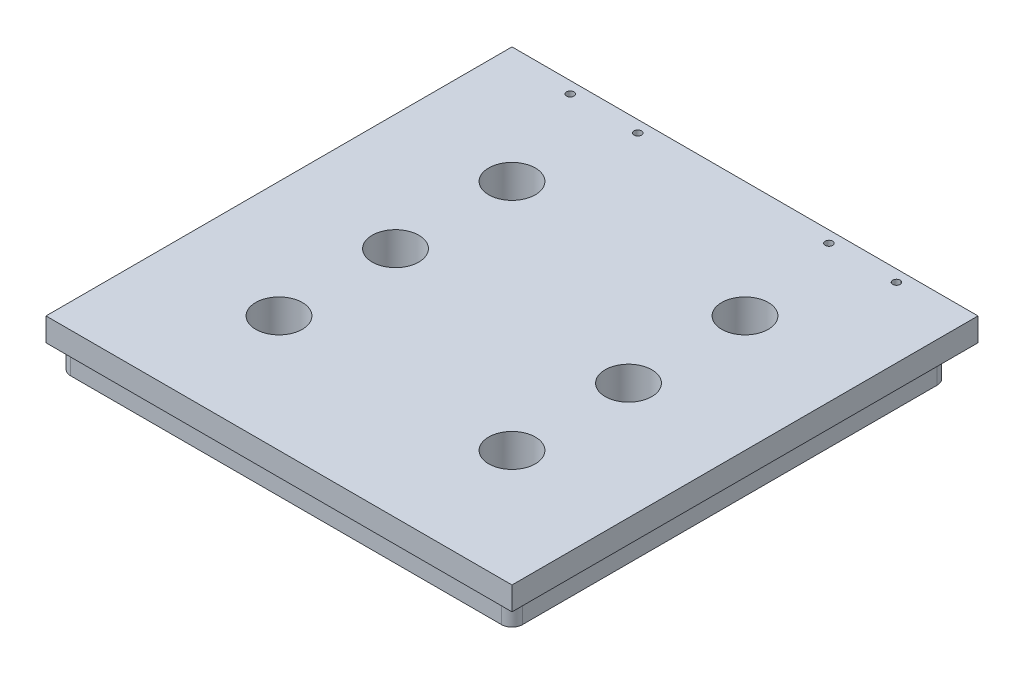
ISO-10303-21;
HEADER;
FILE_DESCRIPTION(('STEP AP214'),'2;1');
FILE_NAME('part.step','',(''),(''),'','','');
FILE_SCHEMA(('AUTOMOTIVE_DESIGN { 1 0 10303 214 1 1 1 1 }'));
ENDSEC;
DATA;
#1=APPLICATION_CONTEXT('core data for automotive mechanical design processes');
#2=APPLICATION_PROTOCOL_DEFINITION('international standard','automotive_design',2000,#1);
#3=PRODUCT_CONTEXT('',#1,'mechanical');
#4=PRODUCT('Part','Part','',(#3));
#5=PRODUCT_RELATED_PRODUCT_CATEGORY('part','',(#4));
#6=PRODUCT_DEFINITION_FORMATION('','',#4);
#7=PRODUCT_DEFINITION_CONTEXT('part definition',#1,'design');
#8=PRODUCT_DEFINITION('design','',#6,#7);
#9=PRODUCT_DEFINITION_SHAPE('','',#8);
#10=(LENGTH_UNIT() NAMED_UNIT(*) SI_UNIT(.MILLI.,.METRE.));
#11=(NAMED_UNIT(*) PLANE_ANGLE_UNIT() SI_UNIT($,.RADIAN.));
#12=(NAMED_UNIT(*) SI_UNIT($,.STERADIAN.) SOLID_ANGLE_UNIT());
#13=UNCERTAINTY_MEASURE_WITH_UNIT(LENGTH_MEASURE(1.E-05),#10,'distance_accuracy_value','');
#14=(GEOMETRIC_REPRESENTATION_CONTEXT(3) GLOBAL_UNCERTAINTY_ASSIGNED_CONTEXT((#13)) GLOBAL_UNIT_ASSIGNED_CONTEXT((#10,
#11,#12)) REPRESENTATION_CONTEXT('',''));
#15=CARTESIAN_POINT('',(0.,0.,0.));
#16=DIRECTION('',(0.,0.,1.));
#17=DIRECTION('',(1.,0.,0.));
#18=AXIS2_PLACEMENT_3D('',#15,#16,#17);
#19=CARTESIAN_POINT('',(0.,0.,0.));
#20=DIRECTION('',(0.,1.,0.));
#21=DIRECTION('',(0.,0.,1.));
#22=AXIS2_PLACEMENT_3D('',#19,#20,#21);
#23=PLANE('',#22);
#24=CARTESIAN_POINT('',(70.,0.,-95.));
#25=DIRECTION('',(0.,1.,0.));
#26=DIRECTION('',(0.,0.,1.));
#27=AXIS2_PLACEMENT_3D('',#24,#25,#26);
#28=CIRCLE('',#27,1.60000000000001);
#29=CARTESIAN_POINT('',(70.,0.,-93.4));
#30=VERTEX_POINT('',#29);
#31=EDGE_CURVE('E370',#30,#30,#28,.T.);
#32=ORIENTED_EDGE('',*,*,#31,.T.);
#33=EDGE_LOOP('',(#32));
#34=FACE_BOUND('',#33,.T.);
#35=CARTESIAN_POINT('',(41.,0.,-95.));
#36=DIRECTION('',(0.,1.,0.));
#37=DIRECTION('',(0.,0.,1.));
#38=AXIS2_PLACEMENT_3D('',#35,#36,#37);
#39=CIRCLE('',#38,1.6);
#40=CARTESIAN_POINT('',(41.,0.,-93.4));
#41=VERTEX_POINT('',#40);
#42=EDGE_CURVE('E379',#41,#41,#39,.T.);
#43=ORIENTED_EDGE('',*,*,#42,.T.);
#44=EDGE_LOOP('',(#43));
#45=FACE_BOUND('',#44,.T.);
#46=CARTESIAN_POINT('',(-70.,0.,-95.));
#47=DIRECTION('',(0.,1.,0.));
#48=DIRECTION('',(0.,0.,1.));
#49=AXIS2_PLACEMENT_3D('',#46,#47,#48);
#50=CIRCLE('',#49,1.60000000000001);
#51=CARTESIAN_POINT('',(-70.,0.,-93.4));
#52=VERTEX_POINT('',#51);
#53=EDGE_CURVE('E389',#52,#52,#50,.F.);
#54=ORIENTED_EDGE('',*,*,#53,.F.);
#55=EDGE_LOOP('',(#54));
#56=FACE_BOUND('',#55,.T.);
#57=CARTESIAN_POINT('',(-41.,0.,-95.));
#58=DIRECTION('',(0.,1.,0.));
#59=DIRECTION('',(0.,0.,1.));
#60=AXIS2_PLACEMENT_3D('',#57,#58,#59);
#61=CIRCLE('',#60,1.6);
#62=CARTESIAN_POINT('',(-41.,0.,-93.4));
#63=VERTEX_POINT('',#62);
#64=EDGE_CURVE('E376',#63,#63,#61,.F.);
#65=ORIENTED_EDGE('',*,*,#64,.F.);
#66=EDGE_LOOP('',(#65));
#67=FACE_BOUND('',#66,.T.);
#68=DIRECTION('',(0.,0.,1.));
#69=VECTOR('',#68,1.);
#70=CARTESIAN_POINT('',(-100.,0.,100.));
#71=LINE('',#70,#69);
#72=CARTESIAN_POINT('',(-100.,0.,-100.));
#73=VERTEX_POINT('',#72);
#74=CARTESIAN_POINT('',(-100.,0.,100.));
#75=VERTEX_POINT('',#74);
#76=EDGE_CURVE('E160',#73,#75,#71,.T.);
#77=ORIENTED_EDGE('',*,*,#76,.F.);
#78=DIRECTION('',(-1.,0.,0.));
#79=VECTOR('',#78,1.);
#80=CARTESIAN_POINT('',(100.,0.,-100.));
#81=LINE('',#80,#79);
#82=CARTESIAN_POINT('',(100.,0.,-100.));
#83=VERTEX_POINT('',#82);
#84=EDGE_CURVE('E156',#83,#73,#81,.T.);
#85=ORIENTED_EDGE('',*,*,#84,.F.);
#86=DIRECTION('',(0.,0.,-1.));
#87=VECTOR('',#86,1.);
#88=CARTESIAN_POINT('',(100.,0.,100.));
#89=LINE('',#88,#87);
#90=CARTESIAN_POINT('',(100.,0.,100.));
#91=VERTEX_POINT('',#90);
#92=EDGE_CURVE('E271',#91,#83,#89,.T.);
#93=ORIENTED_EDGE('',*,*,#92,.F.);
#94=DIRECTION('',(1.,0.,0.));
#95=VECTOR('',#94,1.);
#96=CARTESIAN_POINT('',(100.,0.,100.));
#97=LINE('',#96,#95);
#98=EDGE_CURVE('E268',#75,#91,#97,.T.);
#99=ORIENTED_EDGE('',*,*,#98,.F.);
#100=EDGE_LOOP('',(#77,#85,#93,#99));
#101=FACE_BOUND('',#100,.T.);
#102=DIRECTION('',(0.,0.,-1.));
#103=VECTOR('',#102,1.);
#104=CARTESIAN_POINT('',(-97.,0.,97.));
#105=LINE('',#104,#103);
#106=CARTESIAN_POINT('',(-97.,0.,92.5));
#107=VERTEX_POINT('',#106);
#108=CARTESIAN_POINT('',(-97.,0.,-85.5));
#109=VERTEX_POINT('',#108);
#110=EDGE_CURVE('E215',#107,#109,#105,.T.);
#111=ORIENTED_EDGE('',*,*,#110,.F.);
#112=CARTESIAN_POINT('',(-92.5,0.,92.5));
#113=DIRECTION('',(0.,1.,0.));
#114=DIRECTION('',(0.,0.,1.));
#115=AXIS2_PLACEMENT_3D('',#112,#113,#114);
#116=CIRCLE('',#115,4.5);
#117=CARTESIAN_POINT('',(-92.5,0.,97.));
#118=VERTEX_POINT('',#117);
#119=EDGE_CURVE('E210',#107,#118,#116,.T.);
#120=ORIENTED_EDGE('',*,*,#119,.T.);
#121=DIRECTION('',(-1.,0.,0.));
#122=VECTOR('',#121,1.);
#123=CARTESIAN_POINT('',(-97.,0.,97.));
#124=LINE('',#123,#122);
#125=CARTESIAN_POINT('',(92.5,0.,97.));
#126=VERTEX_POINT('',#125);
#127=EDGE_CURVE('E245',#126,#118,#124,.T.);
#128=ORIENTED_EDGE('',*,*,#127,.F.);
#129=CARTESIAN_POINT('',(92.5,0.,92.5));
#130=DIRECTION('',(0.,1.,0.));
#131=DIRECTION('',(0.,0.,1.));
#132=AXIS2_PLACEMENT_3D('',#129,#130,#131);
#133=CIRCLE('',#132,4.5);
#134=CARTESIAN_POINT('',(97.,0.,92.5));
#135=VERTEX_POINT('',#134);
#136=EDGE_CURVE('E207',#126,#135,#133,.T.);
#137=ORIENTED_EDGE('',*,*,#136,.T.);
#138=DIRECTION('',(0.,0.,1.));
#139=VECTOR('',#138,1.);
#140=CARTESIAN_POINT('',(97.,0.,97.));
#141=LINE('',#140,#139);
#142=CARTESIAN_POINT('',(97.0000000000001,0.,-85.5));
#143=VERTEX_POINT('',#142);
#144=EDGE_CURVE('E254',#143,#135,#141,.T.);
#145=ORIENTED_EDGE('',*,*,#144,.F.);
#146=CARTESIAN_POINT('',(92.5000000000001,0.,-85.5));
#147=DIRECTION('',(0.,1.,0.));
#148=DIRECTION('',(0.,0.,1.));
#149=AXIS2_PLACEMENT_3D('',#146,#147,#148);
#150=CIRCLE('',#149,4.5);
#151=CARTESIAN_POINT('',(92.5000000000001,0.,-90.));
#152=VERTEX_POINT('',#151);
#153=EDGE_CURVE('E11',#143,#152,#150,.T.);
#154=ORIENTED_EDGE('',*,*,#153,.T.);
#155=DIRECTION('',(1.,0.,0.));
#156=VECTOR('',#155,1.);
#157=CARTESIAN_POINT('',(-97.,0.,-90.));
#158=LINE('',#157,#156);
#159=CARTESIAN_POINT('',(-92.5,0.,-90.));
#160=VERTEX_POINT('',#159);
#161=EDGE_CURVE('E216',#160,#152,#158,.T.);
#162=ORIENTED_EDGE('',*,*,#161,.F.);
#163=CARTESIAN_POINT('',(-92.5,0.,-85.5));
#164=DIRECTION('',(0.,1.,0.));
#165=DIRECTION('',(0.,0.,1.));
#166=AXIS2_PLACEMENT_3D('',#163,#164,#165);
#167=CIRCLE('',#166,4.5);
#168=EDGE_CURVE('E54',#160,#109,#167,.T.);
#169=ORIENTED_EDGE('',*,*,#168,.T.);
#170=EDGE_LOOP('',(#111,#120,#128,#137,#145,#154,#162,#169));
#171=FACE_BOUND('',#170,.T.);
#172=ADVANCED_FACE('F45',(#34,#45,#56,#67,#101,#171),#23,.F.);
#173=CARTESIAN_POINT('',(-100.,10.,100.));
#174=DIRECTION('',(1.,0.,0.));
#175=DIRECTION('',(0.,0.,-1.));
#176=AXIS2_PLACEMENT_3D('',#173,#174,#175);
#177=PLANE('',#176);
#178=ORIENTED_EDGE('',*,*,#76,.T.);
#179=DIRECTION('',(0.,-1.,0.));
#180=VECTOR('',#179,1.);
#181=CARTESIAN_POINT('',(-100.,10.,100.));
#182=LINE('',#181,#180);
#183=CARTESIAN_POINT('',(-100.,10.,100.));
#184=VERTEX_POINT('',#183);
#185=EDGE_CURVE('E138',#184,#75,#182,.T.);
#186=ORIENTED_EDGE('',*,*,#185,.F.);
#187=DIRECTION('',(0.,0.,1.));
#188=VECTOR('',#187,1.);
#189=CARTESIAN_POINT('',(-100.,10.,100.));
#190=LINE('',#189,#188);
#191=CARTESIAN_POINT('',(-100.,10.,-100.));
#192=VERTEX_POINT('',#191);
#193=EDGE_CURVE('E146',#192,#184,#190,.T.);
#194=ORIENTED_EDGE('',*,*,#193,.F.);
#195=DIRECTION('',(0.,-1.,0.));
#196=VECTOR('',#195,1.);
#197=CARTESIAN_POINT('',(-100.,10.,-100.));
#198=LINE('',#197,#196);
#199=EDGE_CURVE('E265',#192,#73,#198,.T.);
#200=ORIENTED_EDGE('',*,*,#199,.T.);
#201=EDGE_LOOP('',(#178,#186,#194,#200));
#202=FACE_BOUND('',#201,.T.);
#203=ADVANCED_FACE('F158',(#202),#177,.F.);
#204=CARTESIAN_POINT('',(100.,10.,100.));
#205=DIRECTION('',(0.,0.,-1.));
#206=DIRECTION('',(-1.,0.,0.));
#207=AXIS2_PLACEMENT_3D('',#204,#205,#206);
#208=PLANE('',#207);
#209=ORIENTED_EDGE('',*,*,#98,.T.);
#210=DIRECTION('',(0.,-1.,0.));
#211=VECTOR('',#210,1.);
#212=CARTESIAN_POINT('',(100.,10.,100.));
#213=LINE('',#212,#211);
#214=CARTESIAN_POINT('',(100.,10.,100.));
#215=VERTEX_POINT('',#214);
#216=EDGE_CURVE('E141',#215,#91,#213,.T.);
#217=ORIENTED_EDGE('',*,*,#216,.F.);
#218=DIRECTION('',(1.,0.,0.));
#219=VECTOR('',#218,1.);
#220=CARTESIAN_POINT('',(100.,10.,100.));
#221=LINE('',#220,#219);
#222=EDGE_CURVE('E134',#184,#215,#221,.T.);
#223=ORIENTED_EDGE('',*,*,#222,.F.);
#224=ORIENTED_EDGE('',*,*,#185,.T.);
#225=EDGE_LOOP('',(#209,#217,#223,#224));
#226=FACE_BOUND('',#225,.T.);
#227=ADVANCED_FACE('F136',(#226),#208,.F.);
#228=CARTESIAN_POINT('',(100.,10.,100.));
#229=DIRECTION('',(-1.,0.,0.));
#230=DIRECTION('',(0.,0.,1.));
#231=AXIS2_PLACEMENT_3D('',#228,#229,#230);
#232=PLANE('',#231);
#233=ORIENTED_EDGE('',*,*,#92,.T.);
#234=DIRECTION('',(0.,-1.,0.));
#235=VECTOR('',#234,1.);
#236=CARTESIAN_POINT('',(100.,10.,-100.));
#237=LINE('',#236,#235);
#238=CARTESIAN_POINT('',(100.,10.,-100.));
#239=VERTEX_POINT('',#238);
#240=EDGE_CURVE('E168',#239,#83,#237,.T.);
#241=ORIENTED_EDGE('',*,*,#240,.F.);
#242=DIRECTION('',(0.,0.,-1.));
#243=VECTOR('',#242,1.);
#244=CARTESIAN_POINT('',(100.,10.,100.));
#245=LINE('',#244,#243);
#246=EDGE_CURVE('E145',#215,#239,#245,.T.);
#247=ORIENTED_EDGE('',*,*,#246,.F.);
#248=ORIENTED_EDGE('',*,*,#216,.T.);
#249=EDGE_LOOP('',(#233,#241,#247,#248));
#250=FACE_BOUND('',#249,.T.);
#251=ADVANCED_FACE('F286',(#250),#232,.F.);
#252=CARTESIAN_POINT('',(100.,10.,-100.));
#253=DIRECTION('',(0.,0.,1.));
#254=DIRECTION('',(1.,0.,0.));
#255=AXIS2_PLACEMENT_3D('',#252,#253,#254);
#256=PLANE('',#255);
#257=ORIENTED_EDGE('',*,*,#84,.T.);
#258=ORIENTED_EDGE('',*,*,#199,.F.);
#259=DIRECTION('',(-1.,0.,0.));
#260=VECTOR('',#259,1.);
#261=CARTESIAN_POINT('',(100.,10.,-100.));
#262=LINE('',#261,#260);
#263=EDGE_CURVE('E151',#239,#192,#262,.T.);
#264=ORIENTED_EDGE('',*,*,#263,.F.);
#265=ORIENTED_EDGE('',*,*,#240,.T.);
#266=EDGE_LOOP('',(#257,#258,#264,#265));
#267=FACE_BOUND('',#266,.T.);
#268=ADVANCED_FACE('F282',(#267),#256,.F.);
#269=CARTESIAN_POINT('',(0.,10.,0.));
#270=DIRECTION('',(0.,1.,0.));
#271=DIRECTION('',(0.,0.,1.));
#272=AXIS2_PLACEMENT_3D('',#269,#270,#271);
#273=PLANE('',#272);
#274=CARTESIAN_POINT('',(70.,10.,-95.));
#275=DIRECTION('',(0.,-1.,0.));
#276=DIRECTION('',(0.,0.,1.));
#277=AXIS2_PLACEMENT_3D('',#274,#275,#276);
#278=CIRCLE('',#277,1.60000000000001);
#279=CARTESIAN_POINT('',(70.,10.,-93.4));
#280=VERTEX_POINT('',#279);
#281=EDGE_CURVE('E368',#280,#280,#278,.T.);
#282=ORIENTED_EDGE('',*,*,#281,.T.);
#283=EDGE_LOOP('',(#282));
#284=FACE_BOUND('',#283,.T.);
#285=CARTESIAN_POINT('',(41.,10.,-95.));
#286=DIRECTION('',(0.,-1.,0.));
#287=DIRECTION('',(0.,0.,1.));
#288=AXIS2_PLACEMENT_3D('',#285,#286,#287);
#289=CIRCLE('',#288,1.6);
#290=CARTESIAN_POINT('',(41.,10.,-93.4));
#291=VERTEX_POINT('',#290);
#292=EDGE_CURVE('E372',#291,#291,#289,.T.);
#293=ORIENTED_EDGE('',*,*,#292,.T.);
#294=EDGE_LOOP('',(#293));
#295=FACE_BOUND('',#294,.T.);
#296=CARTESIAN_POINT('',(-70.,10.,-95.));
#297=DIRECTION('',(0.,1.,0.));
#298=DIRECTION('',(0.,0.,1.));
#299=AXIS2_PLACEMENT_3D('',#296,#297,#298);
#300=CIRCLE('',#299,1.60000000000001);
#301=CARTESIAN_POINT('',(-70.,10.,-93.4));
#302=VERTEX_POINT('',#301);
#303=EDGE_CURVE('E385',#302,#302,#300,.T.);
#304=ORIENTED_EDGE('',*,*,#303,.F.);
#305=EDGE_LOOP('',(#304));
#306=FACE_BOUND('',#305,.T.);
#307=CARTESIAN_POINT('',(-41.,10.,-95.));
#308=DIRECTION('',(0.,1.,0.));
#309=DIRECTION('',(0.,0.,1.));
#310=AXIS2_PLACEMENT_3D('',#307,#308,#309);
#311=CIRCLE('',#310,1.6);
#312=CARTESIAN_POINT('',(-41.,10.,-93.4));
#313=VERTEX_POINT('',#312);
#314=EDGE_CURVE('E390',#313,#313,#311,.T.);
#315=ORIENTED_EDGE('',*,*,#314,.F.);
#316=EDGE_LOOP('',(#315));
#317=FACE_BOUND('',#316,.T.);
#318=CARTESIAN_POINT('',(50.,10.,-50.));
#319=DIRECTION('',(0.,-1.,0.));
#320=DIRECTION('',(0.,0.,1.));
#321=AXIS2_PLACEMENT_3D('',#318,#319,#320);
#322=CIRCLE('',#321,10.);
#323=CARTESIAN_POINT('',(50.,10.,-40.));
#324=VERTEX_POINT('',#323);
#325=EDGE_CURVE('E401',#324,#324,#322,.T.);
#326=ORIENTED_EDGE('',*,*,#325,.T.);
#327=EDGE_LOOP('',(#326));
#328=FACE_BOUND('',#327,.T.);
#329=CARTESIAN_POINT('',(50.,10.,0.));
#330=DIRECTION('',(0.,-1.,0.));
#331=DIRECTION('',(0.,0.,1.));
#332=AXIS2_PLACEMENT_3D('',#329,#330,#331);
#333=CIRCLE('',#332,10.);
#334=CARTESIAN_POINT('',(50.,10.,10.));
#335=VERTEX_POINT('',#334);
#336=EDGE_CURVE('E411',#335,#335,#333,.T.);
#337=ORIENTED_EDGE('',*,*,#336,.T.);
#338=EDGE_LOOP('',(#337));
#339=FACE_BOUND('',#338,.T.);
#340=CARTESIAN_POINT('',(50.,10.,50.));
#341=DIRECTION('',(0.,-1.,0.));
#342=DIRECTION('',(0.,0.,1.));
#343=AXIS2_PLACEMENT_3D('',#340,#341,#342);
#344=CIRCLE('',#343,10.);
#345=CARTESIAN_POINT('',(50.,10.,60.));
#346=VERTEX_POINT('',#345);
#347=EDGE_CURVE('E394',#346,#346,#344,.T.);
#348=ORIENTED_EDGE('',*,*,#347,.T.);
#349=EDGE_LOOP('',(#348));
#350=FACE_BOUND('',#349,.T.);
#351=CARTESIAN_POINT('',(-50.,10.,-50.));
#352=DIRECTION('',(0.,1.,0.));
#353=DIRECTION('',(0.,0.,1.));
#354=AXIS2_PLACEMENT_3D('',#351,#352,#353);
#355=CIRCLE('',#354,10.);
#356=CARTESIAN_POINT('',(-50.,10.,-40.));
#357=VERTEX_POINT('',#356);
#358=EDGE_CURVE('E223',#357,#357,#355,.T.);
#359=ORIENTED_EDGE('',*,*,#358,.F.);
#360=EDGE_LOOP('',(#359));
#361=FACE_BOUND('',#360,.T.);
#362=CARTESIAN_POINT('',(-50.,10.,0.));
#363=DIRECTION('',(0.,1.,0.));
#364=DIRECTION('',(0.,0.,1.));
#365=AXIS2_PLACEMENT_3D('',#362,#363,#364);
#366=CIRCLE('',#365,10.);
#367=CARTESIAN_POINT('',(-50.,10.,10.));
#368=VERTEX_POINT('',#367);
#369=EDGE_CURVE('E436',#368,#368,#366,.T.);
#370=ORIENTED_EDGE('',*,*,#369,.F.);
#371=EDGE_LOOP('',(#370));
#372=FACE_BOUND('',#371,.T.);
#373=CARTESIAN_POINT('',(-50.,10.,50.));
#374=DIRECTION('',(0.,1.,0.));
#375=DIRECTION('',(0.,0.,1.));
#376=AXIS2_PLACEMENT_3D('',#373,#374,#375);
#377=CIRCLE('',#376,10.);
#378=CARTESIAN_POINT('',(-50.,10.,60.));
#379=VERTEX_POINT('',#378);
#380=EDGE_CURVE('E410',#379,#379,#377,.T.);
#381=ORIENTED_EDGE('',*,*,#380,.F.);
#382=EDGE_LOOP('',(#381));
#383=FACE_BOUND('',#382,.T.);
#384=ORIENTED_EDGE('',*,*,#193,.T.);
#385=ORIENTED_EDGE('',*,*,#222,.T.);
#386=ORIENTED_EDGE('',*,*,#246,.T.);
#387=ORIENTED_EDGE('',*,*,#263,.T.);
#388=EDGE_LOOP('',(#384,#385,#386,#387));
#389=FACE_BOUND('',#388,.T.);
#390=ADVANCED_FACE('F149',(#284,#295,#306,#317,#328,#339,#350,#361,#372,#383,#389),#273,.T.);
#391=CARTESIAN_POINT('',(-97.,-10.,97.));
#392=DIRECTION('',(1.,0.,0.));
#393=DIRECTION('',(0.,0.,-1.));
#394=AXIS2_PLACEMENT_3D('',#391,#392,#393);
#395=PLANE('',#394);
#396=DIRECTION('',(0.,0.,-1.));
#397=VECTOR('',#396,1.);
#398=CARTESIAN_POINT('',(-97.,-10.,97.));
#399=LINE('',#398,#397);
#400=CARTESIAN_POINT('',(-97.,-10.,92.5));
#401=VERTEX_POINT('',#400);
#402=CARTESIAN_POINT('',(-97.,-10.,-85.5));
#403=VERTEX_POINT('',#402);
#404=EDGE_CURVE('E234',#401,#403,#399,.T.);
#405=ORIENTED_EDGE('',*,*,#404,.F.);
#406=DIRECTION('',(0.,1.,0.));
#407=VECTOR('',#406,1.);
#408=CARTESIAN_POINT('',(-97.,-10.,92.5));
#409=LINE('',#408,#407);
#410=EDGE_CURVE('E197',#401,#107,#409,.T.);
#411=ORIENTED_EDGE('',*,*,#410,.T.);
#412=ORIENTED_EDGE('',*,*,#110,.T.);
#413=DIRECTION('',(0.,1.,0.));
#414=VECTOR('',#413,1.);
#415=CARTESIAN_POINT('',(-97.,-10.,-85.5));
#416=LINE('',#415,#414);
#417=EDGE_CURVE('E194',#109,#403,#416,.F.);
#418=ORIENTED_EDGE('',*,*,#417,.T.);
#419=EDGE_LOOP('',(#405,#411,#412,#418));
#420=FACE_BOUND('',#419,.T.);
#421=ADVANCED_FACE('F219',(#420),#395,.F.);
#422=CARTESIAN_POINT('',(-97.,-10.,-90.));
#423=DIRECTION('',(0.,0.,1.));
#424=DIRECTION('',(1.,0.,0.));
#425=AXIS2_PLACEMENT_3D('',#422,#423,#424);
#426=PLANE('',#425);
#427=DIRECTION('',(1.,0.,0.));
#428=VECTOR('',#427,1.);
#429=CARTESIAN_POINT('',(-97.,-10.,-90.));
#430=LINE('',#429,#428);
#431=CARTESIAN_POINT('',(-92.5,-10.,-90.));
#432=VERTEX_POINT('',#431);
#433=CARTESIAN_POINT('',(92.5000000000001,-10.,-90.));
#434=VERTEX_POINT('',#433);
#435=EDGE_CURVE('E232',#432,#434,#430,.T.);
#436=ORIENTED_EDGE('',*,*,#435,.F.);
#437=DIRECTION('',(0.,1.,0.));
#438=VECTOR('',#437,1.);
#439=CARTESIAN_POINT('',(-92.5,-10.,-90.));
#440=LINE('',#439,#438);
#441=EDGE_CURVE('E204',#432,#160,#440,.T.);
#442=ORIENTED_EDGE('',*,*,#441,.T.);
#443=ORIENTED_EDGE('',*,*,#161,.T.);
#444=DIRECTION('',(0.,1.,0.));
#445=VECTOR('',#444,1.);
#446=CARTESIAN_POINT('',(92.5000000000001,-10.,-90.));
#447=LINE('',#446,#445);
#448=EDGE_CURVE('E201',#152,#434,#447,.F.);
#449=ORIENTED_EDGE('',*,*,#448,.T.);
#450=EDGE_LOOP('',(#436,#442,#443,#449));
#451=FACE_BOUND('',#450,.T.);
#452=ADVANCED_FACE('F236',(#451),#426,.F.);
#453=CARTESIAN_POINT('',(97.,-10.,97.));
#454=DIRECTION('',(-1.,0.,0.));
#455=DIRECTION('',(0.,0.,1.));
#456=AXIS2_PLACEMENT_3D('',#453,#454,#455);
#457=PLANE('',#456);
#458=ORIENTED_EDGE('',*,*,#144,.T.);
#459=DIRECTION('',(0.,1.,0.));
#460=VECTOR('',#459,1.);
#461=CARTESIAN_POINT('',(97.,-10.,92.5));
#462=LINE('',#461,#460);
#463=CARTESIAN_POINT('',(97.,-10.,92.5));
#464=VERTEX_POINT('',#463);
#465=EDGE_CURVE('E179',#135,#464,#462,.F.);
#466=ORIENTED_EDGE('',*,*,#465,.T.);
#467=DIRECTION('',(0.,0.,1.));
#468=VECTOR('',#467,1.);
#469=CARTESIAN_POINT('',(97.,-10.,97.));
#470=LINE('',#469,#468);
#471=CARTESIAN_POINT('',(97.0000000000001,-10.,-85.5));
#472=VERTEX_POINT('',#471);
#473=EDGE_CURVE('E239',#472,#464,#470,.T.);
#474=ORIENTED_EDGE('',*,*,#473,.F.);
#475=DIRECTION('',(0.,1.,0.));
#476=VECTOR('',#475,1.);
#477=CARTESIAN_POINT('',(97.0000000000001,-10.,-85.5));
#478=LINE('',#477,#476);
#479=EDGE_CURVE('E175',#472,#143,#478,.T.);
#480=ORIENTED_EDGE('',*,*,#479,.T.);
#481=EDGE_LOOP('',(#458,#466,#474,#480));
#482=FACE_BOUND('',#481,.T.);
#483=ADVANCED_FACE('F312',(#482),#457,.F.);
#484=CARTESIAN_POINT('',(-97.,-10.,97.));
#485=DIRECTION('',(0.,0.,-1.));
#486=DIRECTION('',(-1.,0.,0.));
#487=AXIS2_PLACEMENT_3D('',#484,#485,#486);
#488=PLANE('',#487);
#489=DIRECTION('',(-1.,0.,0.));
#490=VECTOR('',#489,1.);
#491=CARTESIAN_POINT('',(-97.,-10.,97.));
#492=LINE('',#491,#490);
#493=CARTESIAN_POINT('',(92.5,-10.,97.));
#494=VERTEX_POINT('',#493);
#495=CARTESIAN_POINT('',(-92.5,-10.,97.));
#496=VERTEX_POINT('',#495);
#497=EDGE_CURVE('E243',#494,#496,#492,.T.);
#498=ORIENTED_EDGE('',*,*,#497,.F.);
#499=DIRECTION('',(0.,1.,0.));
#500=VECTOR('',#499,1.);
#501=CARTESIAN_POINT('',(92.5,-10.,97.));
#502=LINE('',#501,#500);
#503=EDGE_CURVE('E166',#494,#126,#502,.T.);
#504=ORIENTED_EDGE('',*,*,#503,.T.);
#505=ORIENTED_EDGE('',*,*,#127,.T.);
#506=DIRECTION('',(0.,1.,0.));
#507=VECTOR('',#506,1.);
#508=CARTESIAN_POINT('',(-92.5,-10.,97.));
#509=LINE('',#508,#507);
#510=EDGE_CURVE('E162',#118,#496,#509,.F.);
#511=ORIENTED_EDGE('',*,*,#510,.T.);
#512=EDGE_LOOP('',(#498,#504,#505,#511));
#513=FACE_BOUND('',#512,.T.);
#514=ADVANCED_FACE('F315',(#513),#488,.F.);
#515=CARTESIAN_POINT('',(0.,-10.,0.));
#516=DIRECTION('',(0.,-1.,0.));
#517=DIRECTION('',(0.,0.,-1.));
#518=AXIS2_PLACEMENT_3D('',#515,#516,#517);
#519=PLANE('',#518);
#520=CARTESIAN_POINT('',(50.,-10.,-50.));
#521=DIRECTION('',(0.,-1.,0.));
#522=DIRECTION('',(0.,0.,-1.));
#523=AXIS2_PLACEMENT_3D('',#520,#521,#522);
#524=CIRCLE('',#523,10.);
#525=CARTESIAN_POINT('',(50.,-10.,-60.));
#526=VERTEX_POINT('',#525);
#527=EDGE_CURVE('E405',#526,#526,#524,.T.);
#528=ORIENTED_EDGE('',*,*,#527,.F.);
#529=EDGE_LOOP('',(#528));
#530=FACE_BOUND('',#529,.T.);
#531=CARTESIAN_POINT('',(50.,-10.,0.));
#532=DIRECTION('',(0.,-1.,0.));
#533=DIRECTION('',(0.,0.,-1.));
#534=AXIS2_PLACEMENT_3D('',#531,#532,#533);
#535=CIRCLE('',#534,10.);
#536=CARTESIAN_POINT('',(50.,-10.,-10.));
#537=VERTEX_POINT('',#536);
#538=EDGE_CURVE('E406',#537,#537,#535,.T.);
#539=ORIENTED_EDGE('',*,*,#538,.F.);
#540=EDGE_LOOP('',(#539));
#541=FACE_BOUND('',#540,.T.);
#542=CARTESIAN_POINT('',(50.,-10.,50.));
#543=DIRECTION('',(0.,-1.,0.));
#544=DIRECTION('',(0.,0.,-1.));
#545=AXIS2_PLACEMENT_3D('',#542,#543,#544);
#546=CIRCLE('',#545,10.);
#547=CARTESIAN_POINT('',(50.,-10.,40.));
#548=VERTEX_POINT('',#547);
#549=EDGE_CURVE('E415',#548,#548,#546,.T.);
#550=ORIENTED_EDGE('',*,*,#549,.F.);
#551=EDGE_LOOP('',(#550));
#552=FACE_BOUND('',#551,.T.);
#553=CARTESIAN_POINT('',(-50.,-10.,-50.));
#554=DIRECTION('',(0.,-1.,0.));
#555=DIRECTION('',(0.,0.,-1.));
#556=AXIS2_PLACEMENT_3D('',#553,#554,#555);
#557=CIRCLE('',#556,10.);
#558=CARTESIAN_POINT('',(-50.,-10.,-60.));
#559=VERTEX_POINT('',#558);
#560=EDGE_CURVE('E428',#559,#559,#557,.F.);
#561=ORIENTED_EDGE('',*,*,#560,.T.);
#562=EDGE_LOOP('',(#561));
#563=FACE_BOUND('',#562,.T.);
#564=CARTESIAN_POINT('',(-50.,-10.,0.));
#565=DIRECTION('',(0.,-1.,0.));
#566=DIRECTION('',(0.,0.,-1.));
#567=AXIS2_PLACEMENT_3D('',#564,#565,#566);
#568=CIRCLE('',#567,10.);
#569=CARTESIAN_POINT('',(-50.,-10.,-10.));
#570=VERTEX_POINT('',#569);
#571=EDGE_CURVE('E432',#570,#570,#568,.F.);
#572=ORIENTED_EDGE('',*,*,#571,.T.);
#573=EDGE_LOOP('',(#572));
#574=FACE_BOUND('',#573,.T.);
#575=CARTESIAN_POINT('',(-50.,-10.,50.));
#576=DIRECTION('',(0.,-1.,0.));
#577=DIRECTION('',(0.,0.,-1.));
#578=AXIS2_PLACEMENT_3D('',#575,#576,#577);
#579=CIRCLE('',#578,10.);
#580=CARTESIAN_POINT('',(-50.,-10.,40.));
#581=VERTEX_POINT('',#580);
#582=EDGE_CURVE('E440',#581,#581,#579,.F.);
#583=ORIENTED_EDGE('',*,*,#582,.T.);
#584=EDGE_LOOP('',(#583));
#585=FACE_BOUND('',#584,.T.);
#586=ORIENTED_EDGE('',*,*,#473,.T.);
#587=CARTESIAN_POINT('',(92.5,-10.,92.5));
#588=DIRECTION('',(0.,-1.,0.));
#589=DIRECTION('',(0.,0.,-1.));
#590=AXIS2_PLACEMENT_3D('',#587,#588,#589);
#591=CIRCLE('',#590,4.5);
#592=EDGE_CURVE('E191',#464,#494,#591,.T.);
#593=ORIENTED_EDGE('',*,*,#592,.T.);
#594=ORIENTED_EDGE('',*,*,#497,.T.);
#595=CARTESIAN_POINT('',(-92.5,-10.,92.5));
#596=DIRECTION('',(0.,-1.,0.));
#597=DIRECTION('',(0.,0.,-1.));
#598=AXIS2_PLACEMENT_3D('',#595,#596,#597);
#599=CIRCLE('',#598,4.5);
#600=EDGE_CURVE('E188',#496,#401,#599,.T.);
#601=ORIENTED_EDGE('',*,*,#600,.T.);
#602=ORIENTED_EDGE('',*,*,#404,.T.);
#603=CARTESIAN_POINT('',(-92.5,-10.,-85.5));
#604=DIRECTION('',(0.,-1.,0.));
#605=DIRECTION('',(0.,0.,-1.));
#606=AXIS2_PLACEMENT_3D('',#603,#604,#605);
#607=CIRCLE('',#606,4.5);
#608=EDGE_CURVE('E185',#403,#432,#607,.T.);
#609=ORIENTED_EDGE('',*,*,#608,.T.);
#610=ORIENTED_EDGE('',*,*,#435,.T.);
#611=CARTESIAN_POINT('',(92.5000000000001,-10.,-85.5));
#612=DIRECTION('',(0.,-1.,0.));
#613=DIRECTION('',(0.,0.,-1.));
#614=AXIS2_PLACEMENT_3D('',#611,#612,#613);
#615=CIRCLE('',#614,4.5);
#616=EDGE_CURVE('E182',#434,#472,#615,.T.);
#617=ORIENTED_EDGE('',*,*,#616,.T.);
#618=EDGE_LOOP('',(#586,#593,#594,#601,#602,#609,#610,#617));
#619=FACE_BOUND('',#618,.T.);
#620=ADVANCED_FACE('F231',(#530,#541,#552,#563,#574,#585,#619),#519,.T.);
#621=CARTESIAN_POINT('',(92.5,-10.,92.5));
#622=DIRECTION('',(0.,1.,0.));
#623=DIRECTION('',(0.,0.,1.));
#624=AXIS2_PLACEMENT_3D('',#621,#622,#623);
#625=CYLINDRICAL_SURFACE('',#624,4.5);
#626=ORIENTED_EDGE('',*,*,#592,.F.);
#627=ORIENTED_EDGE('',*,*,#465,.F.);
#628=ORIENTED_EDGE('',*,*,#136,.F.);
#629=ORIENTED_EDGE('',*,*,#503,.F.);
#630=EDGE_LOOP('',(#626,#627,#628,#629));
#631=FACE_BOUND('',#630,.T.);
#632=ADVANCED_FACE('F322',(#631),#625,.T.);
#633=CARTESIAN_POINT('',(-92.5,-10.,92.5));
#634=DIRECTION('',(0.,1.,0.));
#635=DIRECTION('',(0.,0.,1.));
#636=AXIS2_PLACEMENT_3D('',#633,#634,#635);
#637=CYLINDRICAL_SURFACE('',#636,4.5);
#638=ORIENTED_EDGE('',*,*,#600,.F.);
#639=ORIENTED_EDGE('',*,*,#510,.F.);
#640=ORIENTED_EDGE('',*,*,#119,.F.);
#641=ORIENTED_EDGE('',*,*,#410,.F.);
#642=EDGE_LOOP('',(#638,#639,#640,#641));
#643=FACE_BOUND('',#642,.T.);
#644=ADVANCED_FACE('F536',(#643),#637,.T.);
#645=CARTESIAN_POINT('',(-92.5,-10.,-85.5));
#646=DIRECTION('',(0.,1.,0.));
#647=DIRECTION('',(0.,0.,1.));
#648=AXIS2_PLACEMENT_3D('',#645,#646,#647);
#649=CYLINDRICAL_SURFACE('',#648,4.5);
#650=ORIENTED_EDGE('',*,*,#608,.F.);
#651=ORIENTED_EDGE('',*,*,#417,.F.);
#652=ORIENTED_EDGE('',*,*,#168,.F.);
#653=ORIENTED_EDGE('',*,*,#441,.F.);
#654=EDGE_LOOP('',(#650,#651,#652,#653));
#655=FACE_BOUND('',#654,.T.);
#656=ADVANCED_FACE('F226',(#655),#649,.T.);
#657=CARTESIAN_POINT('',(92.5000000000001,-10.,-85.5));
#658=DIRECTION('',(0.,1.,0.));
#659=DIRECTION('',(0.,0.,1.));
#660=AXIS2_PLACEMENT_3D('',#657,#658,#659);
#661=CYLINDRICAL_SURFACE('',#660,4.5);
#662=ORIENTED_EDGE('',*,*,#616,.F.);
#663=ORIENTED_EDGE('',*,*,#448,.F.);
#664=ORIENTED_EDGE('',*,*,#153,.F.);
#665=ORIENTED_EDGE('',*,*,#479,.F.);
#666=EDGE_LOOP('',(#662,#663,#664,#665));
#667=FACE_BOUND('',#666,.T.);
#668=ADVANCED_FACE('F47',(#667),#661,.T.);
#669=CARTESIAN_POINT('',(-50.,-10.001,50.));
#670=DIRECTION('',(0.,1.,0.));
#671=DIRECTION('',(0.,0.,1.));
#672=AXIS2_PLACEMENT_3D('',#669,#670,#671);
#673=CYLINDRICAL_SURFACE('',#672,10.);
#674=ORIENTED_EDGE('',*,*,#582,.F.);
#675=EDGE_LOOP('',(#674));
#676=FACE_BOUND('',#675,.T.);
#677=ORIENTED_EDGE('',*,*,#380,.T.);
#678=EDGE_LOOP('',(#677));
#679=FACE_BOUND('',#678,.T.);
#680=ADVANCED_FACE('F324',(#676,#679),#673,.F.);
#681=CARTESIAN_POINT('',(-50.,-10.001,0.));
#682=DIRECTION('',(0.,1.,0.));
#683=DIRECTION('',(0.,0.,1.));
#684=AXIS2_PLACEMENT_3D('',#681,#682,#683);
#685=CYLINDRICAL_SURFACE('',#684,10.);
#686=ORIENTED_EDGE('',*,*,#571,.F.);
#687=EDGE_LOOP('',(#686));
#688=FACE_BOUND('',#687,.T.);
#689=ORIENTED_EDGE('',*,*,#369,.T.);
#690=EDGE_LOOP('',(#689));
#691=FACE_BOUND('',#690,.T.);
#692=ADVANCED_FACE('F327',(#688,#691),#685,.F.);
#693=CARTESIAN_POINT('',(-50.,-10.001,-50.));
#694=DIRECTION('',(0.,1.,0.));
#695=DIRECTION('',(0.,0.,1.));
#696=AXIS2_PLACEMENT_3D('',#693,#694,#695);
#697=CYLINDRICAL_SURFACE('',#696,10.);
#698=ORIENTED_EDGE('',*,*,#560,.F.);
#699=EDGE_LOOP('',(#698));
#700=FACE_BOUND('',#699,.T.);
#701=ORIENTED_EDGE('',*,*,#358,.T.);
#702=EDGE_LOOP('',(#701));
#703=FACE_BOUND('',#702,.T.);
#704=ADVANCED_FACE('F331',(#700,#703),#697,.F.);
#705=CARTESIAN_POINT('',(50.,-10.001,50.));
#706=DIRECTION('',(0.,1.,0.));
#707=DIRECTION('',(0.,0.,1.));
#708=AXIS2_PLACEMENT_3D('',#705,#706,#707);
#709=CYLINDRICAL_SURFACE('',#708,10.);
#710=ORIENTED_EDGE('',*,*,#549,.T.);
#711=EDGE_LOOP('',(#710));
#712=FACE_BOUND('',#711,.T.);
#713=ORIENTED_EDGE('',*,*,#347,.F.);
#714=EDGE_LOOP('',(#713));
#715=FACE_BOUND('',#714,.T.);
#716=ADVANCED_FACE('F335',(#712,#715),#709,.F.);
#717=CARTESIAN_POINT('',(50.,-10.001,0.));
#718=DIRECTION('',(0.,1.,0.));
#719=DIRECTION('',(0.,0.,1.));
#720=AXIS2_PLACEMENT_3D('',#717,#718,#719);
#721=CYLINDRICAL_SURFACE('',#720,10.);
#722=ORIENTED_EDGE('',*,*,#538,.T.);
#723=EDGE_LOOP('',(#722));
#724=FACE_BOUND('',#723,.T.);
#725=ORIENTED_EDGE('',*,*,#336,.F.);
#726=EDGE_LOOP('',(#725));
#727=FACE_BOUND('',#726,.T.);
#728=ADVANCED_FACE('F339',(#724,#727),#721,.F.);
#729=CARTESIAN_POINT('',(50.,-10.001,-50.));
#730=DIRECTION('',(0.,1.,0.));
#731=DIRECTION('',(0.,0.,1.));
#732=AXIS2_PLACEMENT_3D('',#729,#730,#731);
#733=CYLINDRICAL_SURFACE('',#732,10.);
#734=ORIENTED_EDGE('',*,*,#527,.T.);
#735=EDGE_LOOP('',(#734));
#736=FACE_BOUND('',#735,.T.);
#737=ORIENTED_EDGE('',*,*,#325,.F.);
#738=EDGE_LOOP('',(#737));
#739=FACE_BOUND('',#738,.T.);
#740=ADVANCED_FACE('F343',(#736,#739),#733,.F.);
#741=CARTESIAN_POINT('',(-41.,-10.001,-95.));
#742=DIRECTION('',(0.,1.,0.));
#743=DIRECTION('',(0.,0.,1.));
#744=AXIS2_PLACEMENT_3D('',#741,#742,#743);
#745=CYLINDRICAL_SURFACE('',#744,1.6);
#746=ORIENTED_EDGE('',*,*,#314,.T.);
#747=EDGE_LOOP('',(#746));
#748=FACE_BOUND('',#747,.T.);
#749=ORIENTED_EDGE('',*,*,#64,.T.);
#750=EDGE_LOOP('',(#749));
#751=FACE_BOUND('',#750,.T.);
#752=ADVANCED_FACE('F347',(#748,#751),#745,.F.);
#753=CARTESIAN_POINT('',(-70.,-10.001,-95.));
#754=DIRECTION('',(0.,1.,0.));
#755=DIRECTION('',(0.,0.,1.));
#756=AXIS2_PLACEMENT_3D('',#753,#754,#755);
#757=CYLINDRICAL_SURFACE('',#756,1.60000000000001);
#758=ORIENTED_EDGE('',*,*,#303,.T.);
#759=EDGE_LOOP('',(#758));
#760=FACE_BOUND('',#759,.T.);
#761=ORIENTED_EDGE('',*,*,#53,.T.);
#762=EDGE_LOOP('',(#761));
#763=FACE_BOUND('',#762,.T.);
#764=ADVANCED_FACE('F351',(#760,#763),#757,.F.);
#765=CARTESIAN_POINT('',(41.,-10.001,-95.));
#766=DIRECTION('',(0.,1.,0.));
#767=DIRECTION('',(0.,0.,1.));
#768=AXIS2_PLACEMENT_3D('',#765,#766,#767);
#769=CYLINDRICAL_SURFACE('',#768,1.6);
#770=ORIENTED_EDGE('',*,*,#292,.F.);
#771=EDGE_LOOP('',(#770));
#772=FACE_BOUND('',#771,.T.);
#773=ORIENTED_EDGE('',*,*,#42,.F.);
#774=EDGE_LOOP('',(#773));
#775=FACE_BOUND('',#774,.T.);
#776=ADVANCED_FACE('F355',(#772,#775),#769,.F.);
#777=CARTESIAN_POINT('',(70.,-10.001,-95.));
#778=DIRECTION('',(0.,1.,0.));
#779=DIRECTION('',(0.,0.,1.));
#780=AXIS2_PLACEMENT_3D('',#777,#778,#779);
#781=CYLINDRICAL_SURFACE('',#780,1.60000000000001);
#782=ORIENTED_EDGE('',*,*,#281,.F.);
#783=EDGE_LOOP('',(#782));
#784=FACE_BOUND('',#783,.T.);
#785=ORIENTED_EDGE('',*,*,#31,.F.);
#786=EDGE_LOOP('',(#785));
#787=FACE_BOUND('',#786,.T.);
#788=ADVANCED_FACE('F359',(#784,#787),#781,.F.);
#789=CLOSED_SHELL('',(#172,#203,#227,#251,#268,#390,#421,#452,#483,#514,#620,#632,#644,#656,
#668,#680,#692,#704,#716,#728,#740,#752,#764,#776,#788));
#790=MANIFOLD_SOLID_BREP('B2',#789);
#791=ADVANCED_BREP_SHAPE_REPRESENTATION('',(#18,#790),#14);
#792=SHAPE_DEFINITION_REPRESENTATION(#9,#791);
ENDSEC;
END-ISO-10303-21;
